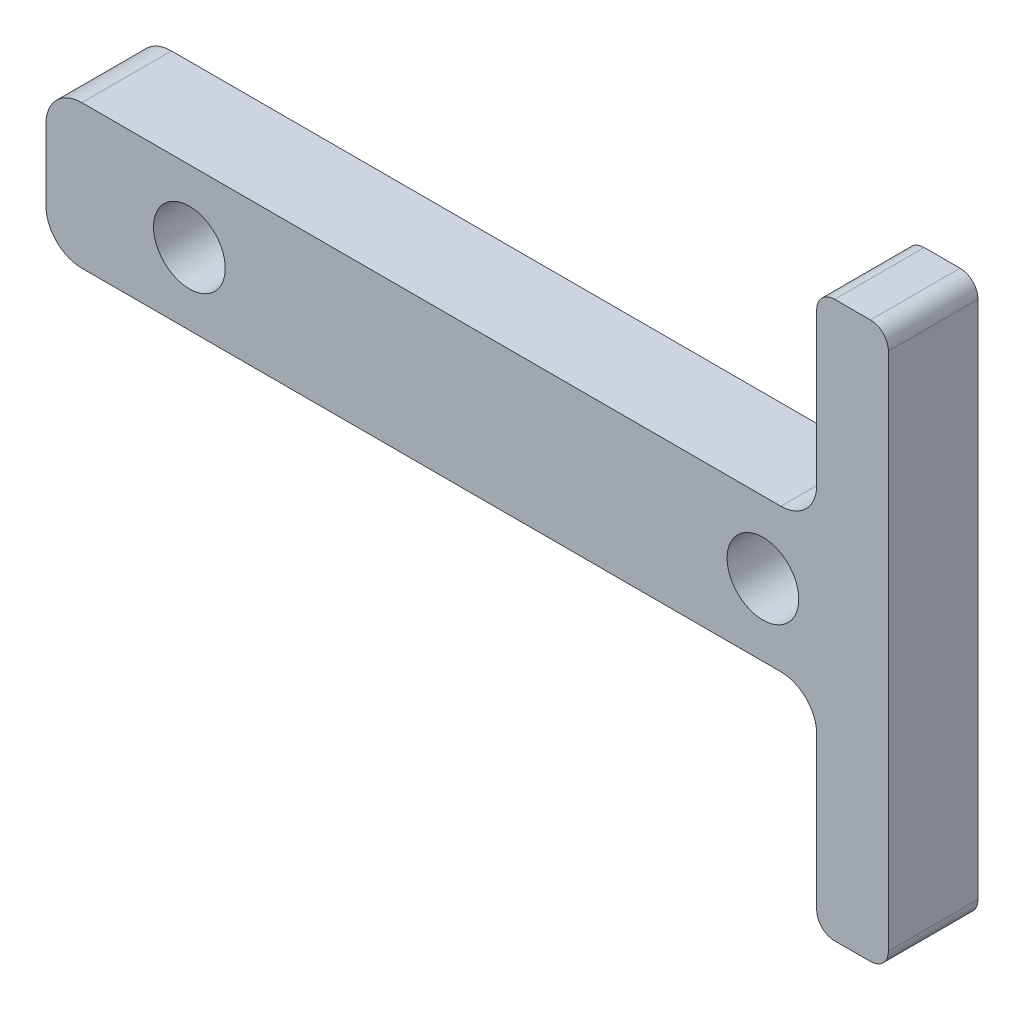
ISO-10303-21;
HEADER;
FILE_DESCRIPTION(('STEP AP214'),'2;1');
FILE_NAME('part.step','',(''),(''),'','','');
FILE_SCHEMA(('AUTOMOTIVE_DESIGN { 1 0 10303 214 1 1 1 1 }'));
ENDSEC;
DATA;
#1=APPLICATION_CONTEXT('core data for automotive mechanical design processes');
#2=APPLICATION_PROTOCOL_DEFINITION('international standard','automotive_design',2000,#1);
#3=PRODUCT_CONTEXT('',#1,'mechanical');
#4=PRODUCT('Part','Part','',(#3));
#5=PRODUCT_RELATED_PRODUCT_CATEGORY('part','',(#4));
#6=PRODUCT_DEFINITION_FORMATION('','',#4);
#7=PRODUCT_DEFINITION_CONTEXT('part definition',#1,'design');
#8=PRODUCT_DEFINITION('design','',#6,#7);
#9=PRODUCT_DEFINITION_SHAPE('','',#8);
#10=(LENGTH_UNIT() NAMED_UNIT(*) SI_UNIT(.MILLI.,.METRE.));
#11=(NAMED_UNIT(*) PLANE_ANGLE_UNIT() SI_UNIT($,.RADIAN.));
#12=(NAMED_UNIT(*) SI_UNIT($,.STERADIAN.) SOLID_ANGLE_UNIT());
#13=UNCERTAINTY_MEASURE_WITH_UNIT(LENGTH_MEASURE(1.E-05),#10,'distance_accuracy_value','');
#14=(GEOMETRIC_REPRESENTATION_CONTEXT(3) GLOBAL_UNCERTAINTY_ASSIGNED_CONTEXT((#13)) GLOBAL_UNIT_ASSIGNED_CONTEXT((#10,
#11,#12)) REPRESENTATION_CONTEXT('',''));
#15=CARTESIAN_POINT('',(0.,0.,0.));
#16=DIRECTION('',(0.,0.,1.));
#17=DIRECTION('',(1.,0.,0.));
#18=AXIS2_PLACEMENT_3D('',#15,#16,#17);
#19=CARTESIAN_POINT('',(19.5,2.,5.));
#20=DIRECTION('',(0.,0.,-1.));
#21=DIRECTION('',(-1.,0.,0.));
#22=AXIS2_PLACEMENT_3D('',#19,#20,#21);
#23=CYLINDRICAL_SURFACE('',#22,2.);
#24=CARTESIAN_POINT('',(19.5,2.,0.));
#25=DIRECTION('',(0.,0.,-1.));
#26=DIRECTION('',(1.,0.,0.));
#27=AXIS2_PLACEMENT_3D('',#24,#25,#26);
#28=CIRCLE('',#27,2.);
#29=CARTESIAN_POINT('',(21.5,2.,0.));
#30=VERTEX_POINT('',#29);
#31=CARTESIAN_POINT('',(19.5,0.,0.));
#32=VERTEX_POINT('',#31);
#33=EDGE_CURVE('E180',#30,#32,#28,.T.);
#34=ORIENTED_EDGE('',*,*,#33,.T.);
#35=DIRECTION('',(0.,0.,-1.));
#36=VECTOR('',#35,1.);
#37=CARTESIAN_POINT('',(19.5,0.,5.));
#38=LINE('',#37,#36);
#39=CARTESIAN_POINT('',(19.5,0.,5.));
#40=VERTEX_POINT('',#39);
#41=EDGE_CURVE('E11',#40,#32,#38,.T.);
#42=ORIENTED_EDGE('',*,*,#41,.F.);
#43=CARTESIAN_POINT('',(19.5,2.,5.));
#44=DIRECTION('',(0.,0.,-1.));
#45=DIRECTION('',(1.,0.,0.));
#46=AXIS2_PLACEMENT_3D('',#43,#44,#45);
#47=CIRCLE('',#46,2.);
#48=CARTESIAN_POINT('',(21.5,2.,5.));
#49=VERTEX_POINT('',#48);
#50=EDGE_CURVE('E211',#49,#40,#47,.T.);
#51=ORIENTED_EDGE('',*,*,#50,.F.);
#52=DIRECTION('',(0.,0.,-1.));
#53=VECTOR('',#52,1.);
#54=CARTESIAN_POINT('',(21.5,2.,5.));
#55=LINE('',#54,#53);
#56=EDGE_CURVE('E176',#49,#30,#55,.T.);
#57=ORIENTED_EDGE('',*,*,#56,.T.);
#58=EDGE_LOOP('',(#34,#42,#51,#57));
#59=FACE_BOUND('',#58,.T.);
#60=ADVANCED_FACE('F36',(#59),#23,.F.);
#61=CARTESIAN_POINT('',(-19.5,0.,5.));
#62=DIRECTION('',(0.,-1.,0.));
#63=DIRECTION('',(1.,0.,0.));
#64=AXIS2_PLACEMENT_3D('',#61,#62,#63);
#65=PLANE('',#64);
#66=DIRECTION('',(-1.,0.,0.));
#67=VECTOR('',#66,1.);
#68=CARTESIAN_POINT('',(-19.5,0.,0.));
#69=LINE('',#68,#67);
#70=CARTESIAN_POINT('',(-19.5,0.,0.));
#71=VERTEX_POINT('',#70);
#72=EDGE_CURVE('E183',#32,#71,#69,.T.);
#73=ORIENTED_EDGE('',*,*,#72,.T.);
#74=DIRECTION('',(0.,0.,-1.));
#75=VECTOR('',#74,1.);
#76=CARTESIAN_POINT('',(-19.5,0.,5.));
#77=LINE('',#76,#75);
#78=CARTESIAN_POINT('',(-19.5,0.,5.));
#79=VERTEX_POINT('',#78);
#80=EDGE_CURVE('E44',#79,#71,#77,.T.);
#81=ORIENTED_EDGE('',*,*,#80,.F.);
#82=DIRECTION('',(-1.,0.,0.));
#83=VECTOR('',#82,1.);
#84=CARTESIAN_POINT('',(-19.5,0.,5.));
#85=LINE('',#84,#83);
#86=EDGE_CURVE('E119',#40,#79,#85,.T.);
#87=ORIENTED_EDGE('',*,*,#86,.F.);
#88=ORIENTED_EDGE('',*,*,#41,.T.);
#89=EDGE_LOOP('',(#73,#81,#87,#88));
#90=FACE_BOUND('',#89,.T.);
#91=ADVANCED_FACE('F310',(#90),#65,.F.);
#92=CARTESIAN_POINT('',(-19.5,-2.,5.));
#93=DIRECTION('',(0.,0.,-1.));
#94=DIRECTION('',(-1.,0.,0.));
#95=AXIS2_PLACEMENT_3D('',#92,#93,#94);
#96=CYLINDRICAL_SURFACE('',#95,2.);
#97=CARTESIAN_POINT('',(-19.5,-2.,0.));
#98=DIRECTION('',(0.,0.,1.));
#99=DIRECTION('',(1.,0.,0.));
#100=AXIS2_PLACEMENT_3D('',#97,#98,#99);
#101=CIRCLE('',#100,2.);
#102=CARTESIAN_POINT('',(-21.5,-2.,0.));
#103=VERTEX_POINT('',#102);
#104=EDGE_CURVE('E186',#71,#103,#101,.T.);
#105=ORIENTED_EDGE('',*,*,#104,.T.);
#106=DIRECTION('',(0.,0.,-1.));
#107=VECTOR('',#106,1.);
#108=CARTESIAN_POINT('',(-21.5,-2.,5.));
#109=LINE('',#108,#107);
#110=CARTESIAN_POINT('',(-21.5,-2.,5.));
#111=VERTEX_POINT('',#110);
#112=EDGE_CURVE('E242',#111,#103,#109,.T.);
#113=ORIENTED_EDGE('',*,*,#112,.F.);
#114=CARTESIAN_POINT('',(-19.5,-2.,5.));
#115=DIRECTION('',(0.,0.,1.));
#116=DIRECTION('',(1.,0.,0.));
#117=AXIS2_PLACEMENT_3D('',#114,#115,#116);
#118=CIRCLE('',#117,2.);
#119=EDGE_CURVE('E250',#79,#111,#118,.T.);
#120=ORIENTED_EDGE('',*,*,#119,.F.);
#121=ORIENTED_EDGE('',*,*,#80,.T.);
#122=EDGE_LOOP('',(#105,#113,#120,#121));
#123=FACE_BOUND('',#122,.T.);
#124=ADVANCED_FACE('F248',(#123),#96,.T.);
#125=CARTESIAN_POINT('',(-21.5,-2.,5.));
#126=DIRECTION('',(1.,0.,0.));
#127=DIRECTION('',(0.,1.,0.));
#128=AXIS2_PLACEMENT_3D('',#125,#126,#127);
#129=PLANE('',#128);
#130=DIRECTION('',(0.,-1.,0.));
#131=VECTOR('',#130,1.);
#132=CARTESIAN_POINT('',(-21.5,-2.,0.));
#133=LINE('',#132,#131);
#134=CARTESIAN_POINT('',(-21.5,-6.,0.));
#135=VERTEX_POINT('',#134);
#136=EDGE_CURVE('E188',#103,#135,#133,.T.);
#137=ORIENTED_EDGE('',*,*,#136,.T.);
#138=DIRECTION('',(0.,0.,-1.));
#139=VECTOR('',#138,1.);
#140=CARTESIAN_POINT('',(-21.5,-6.,5.));
#141=LINE('',#140,#139);
#142=CARTESIAN_POINT('',(-21.5,-6.,5.));
#143=VERTEX_POINT('',#142);
#144=EDGE_CURVE('E239',#143,#135,#141,.T.);
#145=ORIENTED_EDGE('',*,*,#144,.F.);
#146=DIRECTION('',(0.,-1.,0.));
#147=VECTOR('',#146,1.);
#148=CARTESIAN_POINT('',(-21.5,-2.,5.));
#149=LINE('',#148,#147);
#150=EDGE_CURVE('E268',#111,#143,#149,.T.);
#151=ORIENTED_EDGE('',*,*,#150,.F.);
#152=ORIENTED_EDGE('',*,*,#112,.T.);
#153=EDGE_LOOP('',(#137,#145,#151,#152));
#154=FACE_BOUND('',#153,.T.);
#155=ADVANCED_FACE('F259',(#154),#129,.F.);
#156=CARTESIAN_POINT('',(-19.5,-6.,5.));
#157=DIRECTION('',(0.,0.,-1.));
#158=DIRECTION('',(-1.,0.,0.));
#159=AXIS2_PLACEMENT_3D('',#156,#157,#158);
#160=CYLINDRICAL_SURFACE('',#159,2.);
#161=CARTESIAN_POINT('',(-19.5,-6.,0.));
#162=DIRECTION('',(0.,0.,1.));
#163=DIRECTION('',(-1.,0.,0.));
#164=AXIS2_PLACEMENT_3D('',#161,#162,#163);
#165=CIRCLE('',#164,2.);
#166=CARTESIAN_POINT('',(-19.5,-8.,0.));
#167=VERTEX_POINT('',#166);
#168=EDGE_CURVE('E190',#135,#167,#165,.T.);
#169=ORIENTED_EDGE('',*,*,#168,.T.);
#170=DIRECTION('',(0.,0.,-1.));
#171=VECTOR('',#170,1.);
#172=CARTESIAN_POINT('',(-19.5,-8.,5.));
#173=LINE('',#172,#171);
#174=CARTESIAN_POINT('',(-19.5,-8.,5.));
#175=VERTEX_POINT('',#174);
#176=EDGE_CURVE('E236',#175,#167,#173,.T.);
#177=ORIENTED_EDGE('',*,*,#176,.F.);
#178=CARTESIAN_POINT('',(-19.5,-6.,5.));
#179=DIRECTION('',(0.,0.,1.));
#180=DIRECTION('',(-1.,0.,0.));
#181=AXIS2_PLACEMENT_3D('',#178,#179,#180);
#182=CIRCLE('',#181,2.);
#183=EDGE_CURVE('E265',#143,#175,#182,.T.);
#184=ORIENTED_EDGE('',*,*,#183,.F.);
#185=ORIENTED_EDGE('',*,*,#144,.T.);
#186=EDGE_LOOP('',(#169,#177,#184,#185));
#187=FACE_BOUND('',#186,.T.);
#188=ADVANCED_FACE('F263',(#187),#160,.T.);
#189=CARTESIAN_POINT('',(-19.5,-8.,5.));
#190=DIRECTION('',(0.,1.,0.));
#191=DIRECTION('',(0.,0.,1.));
#192=AXIS2_PLACEMENT_3D('',#189,#190,#191);
#193=PLANE('',#192);
#194=DIRECTION('',(1.,0.,0.));
#195=VECTOR('',#194,1.);
#196=CARTESIAN_POINT('',(-19.5,-8.,0.));
#197=LINE('',#196,#195);
#198=CARTESIAN_POINT('',(19.5,-8.,0.));
#199=VERTEX_POINT('',#198);
#200=EDGE_CURVE('E192',#167,#199,#197,.T.);
#201=ORIENTED_EDGE('',*,*,#200,.T.);
#202=DIRECTION('',(0.,0.,-1.));
#203=VECTOR('',#202,1.);
#204=CARTESIAN_POINT('',(19.5,-8.,5.));
#205=LINE('',#204,#203);
#206=CARTESIAN_POINT('',(19.5,-8.,5.));
#207=VERTEX_POINT('',#206);
#208=EDGE_CURVE('E233',#207,#199,#205,.T.);
#209=ORIENTED_EDGE('',*,*,#208,.F.);
#210=DIRECTION('',(1.,0.,0.));
#211=VECTOR('',#210,1.);
#212=CARTESIAN_POINT('',(-19.5,-8.,5.));
#213=LINE('',#212,#211);
#214=EDGE_CURVE('E267',#175,#207,#213,.T.);
#215=ORIENTED_EDGE('',*,*,#214,.F.);
#216=ORIENTED_EDGE('',*,*,#176,.T.);
#217=EDGE_LOOP('',(#201,#209,#215,#216));
#218=FACE_BOUND('',#217,.T.);
#219=ADVANCED_FACE('F323',(#218),#193,.F.);
#220=CARTESIAN_POINT('',(19.5,-10.,5.));
#221=DIRECTION('',(0.,0.,-1.));
#222=DIRECTION('',(-1.,0.,0.));
#223=AXIS2_PLACEMENT_3D('',#220,#221,#222);
#224=CYLINDRICAL_SURFACE('',#223,2.);
#225=CARTESIAN_POINT('',(19.5,-10.,0.));
#226=DIRECTION('',(0.,0.,-1.));
#227=DIRECTION('',(-1.,0.,0.));
#228=AXIS2_PLACEMENT_3D('',#225,#226,#227);
#229=CIRCLE('',#228,2.);
#230=CARTESIAN_POINT('',(21.5,-10.,0.));
#231=VERTEX_POINT('',#230);
#232=EDGE_CURVE('E194',#199,#231,#229,.T.);
#233=ORIENTED_EDGE('',*,*,#232,.T.);
#234=DIRECTION('',(0.,0.,-1.));
#235=VECTOR('',#234,1.);
#236=CARTESIAN_POINT('',(21.5,-10.,5.));
#237=LINE('',#236,#235);
#238=CARTESIAN_POINT('',(21.5,-10.,5.));
#239=VERTEX_POINT('',#238);
#240=EDGE_CURVE('E230',#239,#231,#237,.T.);
#241=ORIENTED_EDGE('',*,*,#240,.F.);
#242=CARTESIAN_POINT('',(19.5,-10.,5.));
#243=DIRECTION('',(0.,0.,-1.));
#244=DIRECTION('',(-1.,0.,0.));
#245=AXIS2_PLACEMENT_3D('',#242,#243,#244);
#246=CIRCLE('',#245,2.);
#247=EDGE_CURVE('E270',#207,#239,#246,.T.);
#248=ORIENTED_EDGE('',*,*,#247,.F.);
#249=ORIENTED_EDGE('',*,*,#208,.T.);
#250=EDGE_LOOP('',(#233,#241,#248,#249));
#251=FACE_BOUND('',#250,.T.);
#252=ADVANCED_FACE('F326',(#251),#224,.F.);
#253=CARTESIAN_POINT('',(21.5,-10.,5.));
#254=DIRECTION('',(1.,0.,0.));
#255=DIRECTION('',(0.,1.,0.));
#256=AXIS2_PLACEMENT_3D('',#253,#254,#255);
#257=PLANE('',#256);
#258=DIRECTION('',(0.,-1.,0.));
#259=VECTOR('',#258,1.);
#260=CARTESIAN_POINT('',(21.5,-10.,0.));
#261=LINE('',#260,#259);
#262=CARTESIAN_POINT('',(21.5,-18.5,0.));
#263=VERTEX_POINT('',#262);
#264=EDGE_CURVE('E196',#231,#263,#261,.T.);
#265=ORIENTED_EDGE('',*,*,#264,.T.);
#266=DIRECTION('',(0.,0.,-1.));
#267=VECTOR('',#266,1.);
#268=CARTESIAN_POINT('',(21.5,-18.5,5.));
#269=LINE('',#268,#267);
#270=CARTESIAN_POINT('',(21.5,-18.5,5.));
#271=VERTEX_POINT('',#270);
#272=EDGE_CURVE('E227',#271,#263,#269,.T.);
#273=ORIENTED_EDGE('',*,*,#272,.F.);
#274=DIRECTION('',(0.,-1.,0.));
#275=VECTOR('',#274,1.);
#276=CARTESIAN_POINT('',(21.5,-10.,5.));
#277=LINE('',#276,#275);
#278=EDGE_CURVE('E276',#239,#271,#277,.T.);
#279=ORIENTED_EDGE('',*,*,#278,.F.);
#280=ORIENTED_EDGE('',*,*,#240,.T.);
#281=EDGE_LOOP('',(#265,#273,#279,#280));
#282=FACE_BOUND('',#281,.T.);
#283=ADVANCED_FACE('F330',(#282),#257,.F.);
#284=CARTESIAN_POINT('',(22.5,-18.5,5.));
#285=DIRECTION('',(0.,0.,-1.));
#286=DIRECTION('',(-1.,0.,0.));
#287=AXIS2_PLACEMENT_3D('',#284,#285,#286);
#288=CYLINDRICAL_SURFACE('',#287,1.);
#289=CARTESIAN_POINT('',(22.5,-18.5,0.));
#290=DIRECTION('',(0.,0.,1.));
#291=DIRECTION('',(1.,0.,0.));
#292=AXIS2_PLACEMENT_3D('',#289,#290,#291);
#293=CIRCLE('',#292,1.);
#294=CARTESIAN_POINT('',(22.5,-19.5,0.));
#295=VERTEX_POINT('',#294);
#296=EDGE_CURVE('E198',#263,#295,#293,.T.);
#297=ORIENTED_EDGE('',*,*,#296,.T.);
#298=DIRECTION('',(0.,0.,-1.));
#299=VECTOR('',#298,1.);
#300=CARTESIAN_POINT('',(22.5,-19.5,5.));
#301=LINE('',#300,#299);
#302=CARTESIAN_POINT('',(22.5,-19.5,5.));
#303=VERTEX_POINT('',#302);
#304=EDGE_CURVE('E224',#303,#295,#301,.T.);
#305=ORIENTED_EDGE('',*,*,#304,.F.);
#306=CARTESIAN_POINT('',(22.5,-18.5,5.));
#307=DIRECTION('',(0.,0.,1.));
#308=DIRECTION('',(1.,0.,0.));
#309=AXIS2_PLACEMENT_3D('',#306,#307,#308);
#310=CIRCLE('',#309,1.);
#311=EDGE_CURVE('E278',#271,#303,#310,.T.);
#312=ORIENTED_EDGE('',*,*,#311,.F.);
#313=ORIENTED_EDGE('',*,*,#272,.T.);
#314=EDGE_LOOP('',(#297,#305,#312,#313));
#315=FACE_BOUND('',#314,.T.);
#316=ADVANCED_FACE('F334',(#315),#288,.T.);
#317=CARTESIAN_POINT('',(22.5,-19.5,5.));
#318=DIRECTION('',(0.,1.,0.));
#319=DIRECTION('',(0.,0.,1.));
#320=AXIS2_PLACEMENT_3D('',#317,#318,#319);
#321=PLANE('',#320);
#322=DIRECTION('',(1.,0.,0.));
#323=VECTOR('',#322,1.);
#324=CARTESIAN_POINT('',(22.5,-19.5,0.));
#325=LINE('',#324,#323);
#326=CARTESIAN_POINT('',(24.5,-19.5,0.));
#327=VERTEX_POINT('',#326);
#328=EDGE_CURVE('E200',#295,#327,#325,.T.);
#329=ORIENTED_EDGE('',*,*,#328,.T.);
#330=DIRECTION('',(0.,0.,-1.));
#331=VECTOR('',#330,1.);
#332=CARTESIAN_POINT('',(24.5,-19.5,5.));
#333=LINE('',#332,#331);
#334=CARTESIAN_POINT('',(24.5,-19.5,5.));
#335=VERTEX_POINT('',#334);
#336=EDGE_CURVE('E221',#335,#327,#333,.T.);
#337=ORIENTED_EDGE('',*,*,#336,.F.);
#338=DIRECTION('',(1.,0.,0.));
#339=VECTOR('',#338,1.);
#340=CARTESIAN_POINT('',(22.5,-19.5,5.));
#341=LINE('',#340,#339);
#342=EDGE_CURVE('E280',#303,#335,#341,.T.);
#343=ORIENTED_EDGE('',*,*,#342,.F.);
#344=ORIENTED_EDGE('',*,*,#304,.T.);
#345=EDGE_LOOP('',(#329,#337,#343,#344));
#346=FACE_BOUND('',#345,.T.);
#347=ADVANCED_FACE('F338',(#346),#321,.F.);
#348=CARTESIAN_POINT('',(24.5,-18.5,5.));
#349=DIRECTION('',(0.,0.,-1.));
#350=DIRECTION('',(-1.,0.,0.));
#351=AXIS2_PLACEMENT_3D('',#348,#349,#350);
#352=CYLINDRICAL_SURFACE('',#351,1.);
#353=CARTESIAN_POINT('',(24.5,-18.5,0.));
#354=DIRECTION('',(0.,0.,1.));
#355=DIRECTION('',(1.,0.,0.));
#356=AXIS2_PLACEMENT_3D('',#353,#354,#355);
#357=CIRCLE('',#356,1.);
#358=CARTESIAN_POINT('',(25.5,-18.5,0.));
#359=VERTEX_POINT('',#358);
#360=EDGE_CURVE('E202',#327,#359,#357,.T.);
#361=ORIENTED_EDGE('',*,*,#360,.T.);
#362=DIRECTION('',(0.,0.,-1.));
#363=VECTOR('',#362,1.);
#364=CARTESIAN_POINT('',(25.5,-18.5,5.));
#365=LINE('',#364,#363);
#366=CARTESIAN_POINT('',(25.5,-18.5,5.));
#367=VERTEX_POINT('',#366);
#368=EDGE_CURVE('E218',#367,#359,#365,.T.);
#369=ORIENTED_EDGE('',*,*,#368,.F.);
#370=CARTESIAN_POINT('',(24.5,-18.5,5.));
#371=DIRECTION('',(0.,0.,1.));
#372=DIRECTION('',(1.,0.,0.));
#373=AXIS2_PLACEMENT_3D('',#370,#371,#372);
#374=CIRCLE('',#373,1.);
#375=EDGE_CURVE('E282',#335,#367,#374,.T.);
#376=ORIENTED_EDGE('',*,*,#375,.F.);
#377=ORIENTED_EDGE('',*,*,#336,.T.);
#378=EDGE_LOOP('',(#361,#369,#376,#377));
#379=FACE_BOUND('',#378,.T.);
#380=ADVANCED_FACE('F342',(#379),#352,.T.);
#381=CARTESIAN_POINT('',(25.5,10.5,5.));
#382=DIRECTION('',(-1.,0.,0.));
#383=DIRECTION('',(0.,-1.,0.));
#384=AXIS2_PLACEMENT_3D('',#381,#382,#383);
#385=PLANE('',#384);
#386=DIRECTION('',(0.,1.,0.));
#387=VECTOR('',#386,1.);
#388=CARTESIAN_POINT('',(25.5,10.5,0.));
#389=LINE('',#388,#387);
#390=CARTESIAN_POINT('',(25.5,10.5,0.));
#391=VERTEX_POINT('',#390);
#392=EDGE_CURVE('E204',#359,#391,#389,.T.);
#393=ORIENTED_EDGE('',*,*,#392,.T.);
#394=DIRECTION('',(0.,0.,-1.));
#395=VECTOR('',#394,1.);
#396=CARTESIAN_POINT('',(25.5,10.5,5.));
#397=LINE('',#396,#395);
#398=CARTESIAN_POINT('',(25.5,10.5,5.));
#399=VERTEX_POINT('',#398);
#400=EDGE_CURVE('E215',#399,#391,#397,.T.);
#401=ORIENTED_EDGE('',*,*,#400,.F.);
#402=DIRECTION('',(0.,1.,0.));
#403=VECTOR('',#402,1.);
#404=CARTESIAN_POINT('',(25.5,10.5,5.));
#405=LINE('',#404,#403);
#406=EDGE_CURVE('E284',#367,#399,#405,.T.);
#407=ORIENTED_EDGE('',*,*,#406,.F.);
#408=ORIENTED_EDGE('',*,*,#368,.T.);
#409=EDGE_LOOP('',(#393,#401,#407,#408));
#410=FACE_BOUND('',#409,.T.);
#411=ADVANCED_FACE('F290',(#410),#385,.F.);
#412=CARTESIAN_POINT('',(24.5,10.5,5.));
#413=DIRECTION('',(0.,0.,-1.));
#414=DIRECTION('',(-1.,0.,0.));
#415=AXIS2_PLACEMENT_3D('',#412,#413,#414);
#416=CYLINDRICAL_SURFACE('',#415,1.);
#417=CARTESIAN_POINT('',(24.5,10.5,0.));
#418=DIRECTION('',(0.,0.,1.));
#419=DIRECTION('',(-1.,0.,0.));
#420=AXIS2_PLACEMENT_3D('',#417,#418,#419);
#421=CIRCLE('',#420,1.);
#422=CARTESIAN_POINT('',(24.5,11.5,0.));
#423=VERTEX_POINT('',#422);
#424=EDGE_CURVE('E206',#391,#423,#421,.T.);
#425=ORIENTED_EDGE('',*,*,#424,.T.);
#426=DIRECTION('',(0.,0.,-1.));
#427=VECTOR('',#426,1.);
#428=CARTESIAN_POINT('',(24.5,11.5,5.));
#429=LINE('',#428,#427);
#430=CARTESIAN_POINT('',(24.5,11.5,5.));
#431=VERTEX_POINT('',#430);
#432=EDGE_CURVE('E171',#431,#423,#429,.T.);
#433=ORIENTED_EDGE('',*,*,#432,.F.);
#434=CARTESIAN_POINT('',(24.5,10.5,5.));
#435=DIRECTION('',(0.,0.,1.));
#436=DIRECTION('',(-1.,0.,0.));
#437=AXIS2_PLACEMENT_3D('',#434,#435,#436);
#438=CIRCLE('',#437,1.);
#439=EDGE_CURVE('E162',#399,#431,#438,.T.);
#440=ORIENTED_EDGE('',*,*,#439,.F.);
#441=ORIENTED_EDGE('',*,*,#400,.T.);
#442=EDGE_LOOP('',(#425,#433,#440,#441));
#443=FACE_BOUND('',#442,.T.);
#444=ADVANCED_FACE('F294',(#443),#416,.T.);
#445=CARTESIAN_POINT('',(22.5,11.5,5.));
#446=DIRECTION('',(0.,-1.,0.));
#447=DIRECTION('',(0.,0.,-1.));
#448=AXIS2_PLACEMENT_3D('',#445,#446,#447);
#449=PLANE('',#448);
#450=DIRECTION('',(-1.,0.,0.));
#451=VECTOR('',#450,1.);
#452=CARTESIAN_POINT('',(22.5,11.5,0.));
#453=LINE('',#452,#451);
#454=CARTESIAN_POINT('',(22.5,11.5,0.));
#455=VERTEX_POINT('',#454);
#456=EDGE_CURVE('E170',#423,#455,#453,.T.);
#457=ORIENTED_EDGE('',*,*,#456,.T.);
#458=DIRECTION('',(0.,0.,-1.));
#459=VECTOR('',#458,1.);
#460=CARTESIAN_POINT('',(22.5,11.5,5.));
#461=LINE('',#460,#459);
#462=CARTESIAN_POINT('',(22.5,11.5,5.));
#463=VERTEX_POINT('',#462);
#464=EDGE_CURVE('E167',#463,#455,#461,.T.);
#465=ORIENTED_EDGE('',*,*,#464,.F.);
#466=DIRECTION('',(-1.,0.,0.));
#467=VECTOR('',#466,1.);
#468=CARTESIAN_POINT('',(22.5,11.5,5.));
#469=LINE('',#468,#467);
#470=EDGE_CURVE('E156',#431,#463,#469,.T.);
#471=ORIENTED_EDGE('',*,*,#470,.F.);
#472=ORIENTED_EDGE('',*,*,#432,.T.);
#473=EDGE_LOOP('',(#457,#465,#471,#472));
#474=FACE_BOUND('',#473,.T.);
#475=ADVANCED_FACE('F168',(#474),#449,.F.);
#476=CARTESIAN_POINT('',(22.5,10.5,5.));
#477=DIRECTION('',(0.,0.,-1.));
#478=DIRECTION('',(-1.,0.,0.));
#479=AXIS2_PLACEMENT_3D('',#476,#477,#478);
#480=CYLINDRICAL_SURFACE('',#479,1.);
#481=CARTESIAN_POINT('',(22.5,10.5,0.));
#482=DIRECTION('',(0.,0.,1.));
#483=DIRECTION('',(-1.,0.,0.));
#484=AXIS2_PLACEMENT_3D('',#481,#482,#483);
#485=CIRCLE('',#484,1.);
#486=CARTESIAN_POINT('',(21.5,10.5,0.));
#487=VERTEX_POINT('',#486);
#488=EDGE_CURVE('E105',#455,#487,#485,.T.);
#489=ORIENTED_EDGE('',*,*,#488,.T.);
#490=DIRECTION('',(0.,0.,-1.));
#491=VECTOR('',#490,1.);
#492=CARTESIAN_POINT('',(21.5,10.5,5.));
#493=LINE('',#492,#491);
#494=CARTESIAN_POINT('',(21.5,10.5,5.));
#495=VERTEX_POINT('',#494);
#496=EDGE_CURVE('E172',#495,#487,#493,.T.);
#497=ORIENTED_EDGE('',*,*,#496,.F.);
#498=CARTESIAN_POINT('',(22.5,10.5,5.));
#499=DIRECTION('',(0.,0.,1.));
#500=DIRECTION('',(-1.,0.,0.));
#501=AXIS2_PLACEMENT_3D('',#498,#499,#500);
#502=CIRCLE('',#501,1.);
#503=EDGE_CURVE('E160',#463,#495,#502,.T.);
#504=ORIENTED_EDGE('',*,*,#503,.F.);
#505=ORIENTED_EDGE('',*,*,#464,.T.);
#506=EDGE_LOOP('',(#489,#497,#504,#505));
#507=FACE_BOUND('',#506,.T.);
#508=ADVANCED_FACE('F174',(#507),#480,.T.);
#509=CARTESIAN_POINT('',(21.5,2.,5.));
#510=DIRECTION('',(1.,0.,0.));
#511=DIRECTION('',(0.,1.,0.));
#512=AXIS2_PLACEMENT_3D('',#509,#510,#511);
#513=PLANE('',#512);
#514=DIRECTION('',(0.,-1.,0.));
#515=VECTOR('',#514,1.);
#516=CARTESIAN_POINT('',(21.5,2.,0.));
#517=LINE('',#516,#515);
#518=EDGE_CURVE('E111',#487,#30,#517,.T.);
#519=ORIENTED_EDGE('',*,*,#518,.T.);
#520=ORIENTED_EDGE('',*,*,#56,.F.);
#521=DIRECTION('',(0.,-1.,0.));
#522=VECTOR('',#521,1.);
#523=CARTESIAN_POINT('',(21.5,2.,5.));
#524=LINE('',#523,#522);
#525=EDGE_CURVE('E52',#495,#49,#524,.T.);
#526=ORIENTED_EDGE('',*,*,#525,.F.);
#527=ORIENTED_EDGE('',*,*,#496,.T.);
#528=EDGE_LOOP('',(#519,#520,#526,#527));
#529=FACE_BOUND('',#528,.T.);
#530=ADVANCED_FACE('F298',(#529),#513,.F.);
#531=CARTESIAN_POINT('',(19.5,2.,5.));
#532=DIRECTION('',(0.,0.,1.));
#533=DIRECTION('',(1.,0.,0.));
#534=AXIS2_PLACEMENT_3D('',#531,#532,#533);
#535=PLANE('',#534);
#536=CARTESIAN_POINT('',(18.5,-4.,5.));
#537=DIRECTION('',(0.,0.,1.));
#538=DIRECTION('',(1.,0.,0.));
#539=AXIS2_PLACEMENT_3D('',#536,#537,#538);
#540=CIRCLE('',#539,2.);
#541=CARTESIAN_POINT('',(20.5,-4.,5.));
#542=VERTEX_POINT('',#541);
#543=EDGE_CURVE('E521',#542,#542,#540,.T.);
#544=ORIENTED_EDGE('',*,*,#543,.F.);
#545=EDGE_LOOP('',(#544));
#546=FACE_BOUND('',#545,.T.);
#547=CARTESIAN_POINT('',(-13.5,-4.,5.));
#548=DIRECTION('',(0.,0.,1.));
#549=DIRECTION('',(1.,0.,0.));
#550=AXIS2_PLACEMENT_3D('',#547,#548,#549);
#551=CIRCLE('',#550,2.);
#552=CARTESIAN_POINT('',(-11.5,-4.,5.));
#553=VERTEX_POINT('',#552);
#554=EDGE_CURVE('E522',#553,#553,#551,.T.);
#555=ORIENTED_EDGE('',*,*,#554,.F.);
#556=EDGE_LOOP('',(#555));
#557=FACE_BOUND('',#556,.T.);
#558=ORIENTED_EDGE('',*,*,#50,.T.);
#559=ORIENTED_EDGE('',*,*,#86,.T.);
#560=ORIENTED_EDGE('',*,*,#119,.T.);
#561=ORIENTED_EDGE('',*,*,#150,.T.);
#562=ORIENTED_EDGE('',*,*,#183,.T.);
#563=ORIENTED_EDGE('',*,*,#214,.T.);
#564=ORIENTED_EDGE('',*,*,#247,.T.);
#565=ORIENTED_EDGE('',*,*,#278,.T.);
#566=ORIENTED_EDGE('',*,*,#311,.T.);
#567=ORIENTED_EDGE('',*,*,#342,.T.);
#568=ORIENTED_EDGE('',*,*,#375,.T.);
#569=ORIENTED_EDGE('',*,*,#406,.T.);
#570=ORIENTED_EDGE('',*,*,#439,.T.);
#571=ORIENTED_EDGE('',*,*,#470,.T.);
#572=ORIENTED_EDGE('',*,*,#503,.T.);
#573=ORIENTED_EDGE('',*,*,#525,.T.);
#574=EDGE_LOOP('',(#558,#559,#560,#561,#562,#563,#564,#565,#566,#567,#568,#569,#570,#571,#572,#573));
#575=FACE_BOUND('',#574,.T.);
#576=ADVANCED_FACE('F158',(#546,#557,#575),#535,.T.);
#577=CARTESIAN_POINT('',(19.5,2.,0.));
#578=DIRECTION('',(0.,0.,1.));
#579=DIRECTION('',(1.,0.,0.));
#580=AXIS2_PLACEMENT_3D('',#577,#578,#579);
#581=PLANE('',#580);
#582=CARTESIAN_POINT('',(18.5,-4.,0.));
#583=DIRECTION('',(0.,0.,1.));
#584=DIRECTION('',(1.,0.,0.));
#585=AXIS2_PLACEMENT_3D('',#582,#583,#584);
#586=CIRCLE('',#585,2.);
#587=CARTESIAN_POINT('',(20.5,-4.,0.));
#588=VERTEX_POINT('',#587);
#589=EDGE_CURVE('E184',#588,#588,#586,.T.);
#590=ORIENTED_EDGE('',*,*,#589,.T.);
#591=EDGE_LOOP('',(#590));
#592=FACE_BOUND('',#591,.T.);
#593=CARTESIAN_POINT('',(-13.5,-4.,0.));
#594=DIRECTION('',(0.,0.,1.));
#595=DIRECTION('',(1.,0.,0.));
#596=AXIS2_PLACEMENT_3D('',#593,#594,#595);
#597=CIRCLE('',#596,2.);
#598=CARTESIAN_POINT('',(-11.5,-4.,0.));
#599=VERTEX_POINT('',#598);
#600=EDGE_CURVE('E526',#599,#599,#597,.T.);
#601=ORIENTED_EDGE('',*,*,#600,.T.);
#602=EDGE_LOOP('',(#601));
#603=FACE_BOUND('',#602,.T.);
#604=ORIENTED_EDGE('',*,*,#33,.F.);
#605=ORIENTED_EDGE('',*,*,#518,.F.);
#606=ORIENTED_EDGE('',*,*,#488,.F.);
#607=ORIENTED_EDGE('',*,*,#456,.F.);
#608=ORIENTED_EDGE('',*,*,#424,.F.);
#609=ORIENTED_EDGE('',*,*,#392,.F.);
#610=ORIENTED_EDGE('',*,*,#360,.F.);
#611=ORIENTED_EDGE('',*,*,#328,.F.);
#612=ORIENTED_EDGE('',*,*,#296,.F.);
#613=ORIENTED_EDGE('',*,*,#264,.F.);
#614=ORIENTED_EDGE('',*,*,#232,.F.);
#615=ORIENTED_EDGE('',*,*,#200,.F.);
#616=ORIENTED_EDGE('',*,*,#168,.F.);
#617=ORIENTED_EDGE('',*,*,#136,.F.);
#618=ORIENTED_EDGE('',*,*,#104,.F.);
#619=ORIENTED_EDGE('',*,*,#72,.F.);
#620=EDGE_LOOP('',(#604,#605,#606,#607,#608,#609,#610,#611,#612,#613,#614,#615,#616,#617,#618,#619));
#621=FACE_BOUND('',#620,.T.);
#622=ADVANCED_FACE('F254',(#592,#603,#621),#581,.F.);
#623=CARTESIAN_POINT('',(-13.5,-4.,0.));
#624=DIRECTION('',(0.,0.,1.));
#625=DIRECTION('',(1.,0.,0.));
#626=AXIS2_PLACEMENT_3D('',#623,#624,#625);
#627=CYLINDRICAL_SURFACE('',#626,2.);
#628=ORIENTED_EDGE('',*,*,#600,.F.);
#629=EDGE_LOOP('',(#628));
#630=FACE_BOUND('',#629,.T.);
#631=ORIENTED_EDGE('',*,*,#554,.T.);
#632=EDGE_LOOP('',(#631));
#633=FACE_BOUND('',#632,.T.);
#634=ADVANCED_FACE('F382',(#630,#633),#627,.F.);
#635=CARTESIAN_POINT('',(18.5,-4.,0.));
#636=DIRECTION('',(0.,0.,1.));
#637=DIRECTION('',(1.,0.,0.));
#638=AXIS2_PLACEMENT_3D('',#635,#636,#637);
#639=CYLINDRICAL_SURFACE('',#638,2.);
#640=ORIENTED_EDGE('',*,*,#589,.F.);
#641=EDGE_LOOP('',(#640));
#642=FACE_BOUND('',#641,.T.);
#643=ORIENTED_EDGE('',*,*,#543,.T.);
#644=EDGE_LOOP('',(#643));
#645=FACE_BOUND('',#644,.T.);
#646=ADVANCED_FACE('F392',(#642,#645),#639,.F.);
#647=CLOSED_SHELL('',(#60,#91,#124,#155,#188,#219,#252,#283,#316,#347,#380,#411,#444,#475,#508,
#530,#576,#622,#634,#646));
#648=MANIFOLD_SOLID_BREP('B2',#647);
#649=ADVANCED_BREP_SHAPE_REPRESENTATION('',(#18,#648),#14);
#650=SHAPE_DEFINITION_REPRESENTATION(#9,#649);
ENDSEC;
END-ISO-10303-21;
